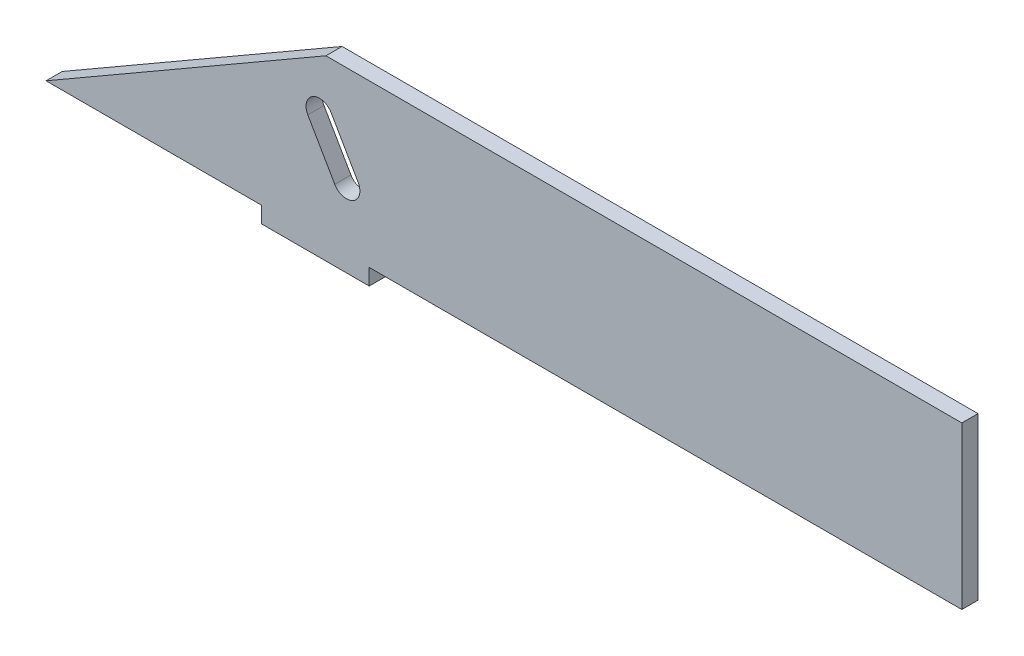
ISO-10303-21;
HEADER;
FILE_DESCRIPTION(('STEP AP214'),'2;1');
FILE_NAME('part.step','',(''),(''),'','','');
FILE_SCHEMA(('AUTOMOTIVE_DESIGN { 1 0 10303 214 1 1 1 1 }'));
ENDSEC;
DATA;
#1=APPLICATION_CONTEXT('core data for automotive mechanical design processes');
#2=APPLICATION_PROTOCOL_DEFINITION('international standard','automotive_design',2000,#1);
#3=PRODUCT_CONTEXT('',#1,'mechanical');
#4=PRODUCT('Part','Part','',(#3));
#5=PRODUCT_RELATED_PRODUCT_CATEGORY('part','',(#4));
#6=PRODUCT_DEFINITION_FORMATION('','',#4);
#7=PRODUCT_DEFINITION_CONTEXT('part definition',#1,'design');
#8=PRODUCT_DEFINITION('design','',#6,#7);
#9=PRODUCT_DEFINITION_SHAPE('','',#8);
#10=(LENGTH_UNIT() NAMED_UNIT(*) SI_UNIT(.MILLI.,.METRE.));
#11=(NAMED_UNIT(*) PLANE_ANGLE_UNIT() SI_UNIT($,.RADIAN.));
#12=(NAMED_UNIT(*) SI_UNIT($,.STERADIAN.) SOLID_ANGLE_UNIT());
#13=UNCERTAINTY_MEASURE_WITH_UNIT(LENGTH_MEASURE(1.E-05),#10,'distance_accuracy_value','');
#14=(GEOMETRIC_REPRESENTATION_CONTEXT(3) GLOBAL_UNCERTAINTY_ASSIGNED_CONTEXT((#13)) GLOBAL_UNIT_ASSIGNED_CONTEXT((#10,
#11,#12)) REPRESENTATION_CONTEXT('',''));
#15=CARTESIAN_POINT('',(0.,0.,0.));
#16=DIRECTION('',(0.,0.,1.));
#17=DIRECTION('',(1.,0.,0.));
#18=AXIS2_PLACEMENT_3D('',#15,#16,#17);
#19=CARTESIAN_POINT('',(50.,15.,3.));
#20=DIRECTION('',(0.,-1.,0.));
#21=DIRECTION('',(1.,0.,0.));
#22=AXIS2_PLACEMENT_3D('',#19,#20,#21);
#23=PLANE('',#22);
#24=DIRECTION('',(0.,0.,-1.));
#25=VECTOR('',#24,1.);
#26=CARTESIAN_POINT('',(1.96152422706574,15.,138.433806901228));
#27=LINE('',#26,#25);
#28=CARTESIAN_POINT('',(1.96152422706574,15.,3.00000000000006));
#29=VERTEX_POINT('',#28);
#30=CARTESIAN_POINT('',(1.9615242270659,15.,0.));
#31=VERTEX_POINT('',#30);
#32=EDGE_CURVE('E195',#29,#31,#27,.T.);
#33=ORIENTED_EDGE('',*,*,#32,.F.);
#34=DIRECTION('',(-1.,0.,0.));
#35=VECTOR('',#34,1.);
#36=CARTESIAN_POINT('',(50.,15.,3.));
#37=LINE('',#36,#35);
#38=CARTESIAN_POINT('',(120.,15.,3.));
#39=VERTEX_POINT('',#38);
#40=EDGE_CURVE('E141',#39,#29,#37,.T.);
#41=ORIENTED_EDGE('',*,*,#40,.F.);
#42=DIRECTION('',(0.,0.,1.));
#43=VECTOR('',#42,1.);
#44=CARTESIAN_POINT('',(120.,15.,3.));
#45=LINE('',#44,#43);
#46=CARTESIAN_POINT('',(120.,15.,0.));
#47=VERTEX_POINT('',#46);
#48=EDGE_CURVE('E157',#47,#39,#45,.T.);
#49=ORIENTED_EDGE('',*,*,#48,.F.);
#50=DIRECTION('',(-1.,0.,0.));
#51=VECTOR('',#50,1.);
#52=CARTESIAN_POINT('',(50.,15.,0.));
#53=LINE('',#52,#51);
#54=EDGE_CURVE('E205',#47,#31,#53,.T.);
#55=ORIENTED_EDGE('',*,*,#54,.T.);
#56=EDGE_LOOP('',(#33,#41,#49,#55));
#57=FACE_BOUND('',#56,.T.);
#58=ADVANCED_FACE('F39',(#57),#23,.F.);
#59=CARTESIAN_POINT('',(-10.,-15.,3.));
#60=DIRECTION('',(0.,1.,0.));
#61=DIRECTION('',(-1.,0.,0.));
#62=AXIS2_PLACEMENT_3D('',#59,#60,#61);
#63=PLANE('',#62);
#64=DIRECTION('',(1.,0.,0.));
#65=VECTOR('',#64,1.);
#66=CARTESIAN_POINT('',(-10.,-15.,0.));
#67=LINE('',#66,#65);
#68=CARTESIAN_POINT('',(-50.,-15.,0.));
#69=VERTEX_POINT('',#68);
#70=CARTESIAN_POINT('',(-10.,-15.,0.));
#71=VERTEX_POINT('',#70);
#72=EDGE_CURVE('E194',#69,#71,#67,.T.);
#73=ORIENTED_EDGE('',*,*,#72,.T.);
#74=DIRECTION('',(0.,0.,-1.));
#75=VECTOR('',#74,1.);
#76=CARTESIAN_POINT('',(-10.,-15.,3.));
#77=LINE('',#76,#75);
#78=CARTESIAN_POINT('',(-10.,-15.,3.));
#79=VERTEX_POINT('',#78);
#80=EDGE_CURVE('E242',#79,#71,#77,.T.);
#81=ORIENTED_EDGE('',*,*,#80,.F.);
#82=DIRECTION('',(1.,0.,0.));
#83=VECTOR('',#82,1.);
#84=CARTESIAN_POINT('',(-10.,-15.,3.));
#85=LINE('',#84,#83);
#86=CARTESIAN_POINT('',(-50.,-15.,3.));
#87=VERTEX_POINT('',#86);
#88=EDGE_CURVE('E201',#87,#79,#85,.T.);
#89=ORIENTED_EDGE('',*,*,#88,.F.);
#90=DIRECTION('',(0.,0.,-1.));
#91=VECTOR('',#90,1.);
#92=CARTESIAN_POINT('',(-50.,-15.,3.));
#93=LINE('',#92,#91);
#94=EDGE_CURVE('E246',#87,#69,#93,.T.);
#95=ORIENTED_EDGE('',*,*,#94,.T.);
#96=EDGE_LOOP('',(#73,#81,#89,#95));
#97=FACE_BOUND('',#96,.T.);
#98=ADVANCED_FACE('F41',(#97),#63,.F.);
#99=CARTESIAN_POINT('',(-10.,-15.,3.));
#100=DIRECTION('',(1.,0.,0.));
#101=DIRECTION('',(0.,0.,-1.));
#102=AXIS2_PLACEMENT_3D('',#99,#100,#101);
#103=PLANE('',#102);
#104=DIRECTION('',(0.,-1.,0.));
#105=VECTOR('',#104,1.);
#106=CARTESIAN_POINT('',(-10.,-15.,0.));
#107=LINE('',#106,#105);
#108=CARTESIAN_POINT('',(-10.,-18.,0.));
#109=VERTEX_POINT('',#108);
#110=EDGE_CURVE('E218',#71,#109,#107,.T.);
#111=ORIENTED_EDGE('',*,*,#110,.T.);
#112=DIRECTION('',(0.,0.,-1.));
#113=VECTOR('',#112,1.);
#114=CARTESIAN_POINT('',(-10.,-18.,3.));
#115=LINE('',#114,#113);
#116=CARTESIAN_POINT('',(-10.,-18.,3.));
#117=VERTEX_POINT('',#116);
#118=EDGE_CURVE('E238',#117,#109,#115,.T.);
#119=ORIENTED_EDGE('',*,*,#118,.F.);
#120=DIRECTION('',(0.,-1.,0.));
#121=VECTOR('',#120,1.);
#122=CARTESIAN_POINT('',(-10.,-15.,3.));
#123=LINE('',#122,#121);
#124=EDGE_CURVE('E204',#79,#117,#123,.T.);
#125=ORIENTED_EDGE('',*,*,#124,.F.);
#126=ORIENTED_EDGE('',*,*,#80,.T.);
#127=EDGE_LOOP('',(#111,#119,#125,#126));
#128=FACE_BOUND('',#127,.T.);
#129=ADVANCED_FACE('F291',(#128),#103,.F.);
#130=CARTESIAN_POINT('',(-10.,-18.,3.));
#131=DIRECTION('',(0.,1.,0.));
#132=DIRECTION('',(0.,0.,1.));
#133=AXIS2_PLACEMENT_3D('',#130,#131,#132);
#134=PLANE('',#133);
#135=DIRECTION('',(1.,0.,0.));
#136=VECTOR('',#135,1.);
#137=CARTESIAN_POINT('',(-10.,-18.,0.));
#138=LINE('',#137,#136);
#139=CARTESIAN_POINT('',(10.,-18.,0.));
#140=VERTEX_POINT('',#139);
#141=EDGE_CURVE('E221',#109,#140,#138,.T.);
#142=ORIENTED_EDGE('',*,*,#141,.T.);
#143=DIRECTION('',(0.,0.,-1.));
#144=VECTOR('',#143,1.);
#145=CARTESIAN_POINT('',(10.,-18.,3.));
#146=LINE('',#145,#144);
#147=CARTESIAN_POINT('',(10.,-18.,3.));
#148=VERTEX_POINT('',#147);
#149=EDGE_CURVE('E234',#148,#140,#146,.T.);
#150=ORIENTED_EDGE('',*,*,#149,.F.);
#151=DIRECTION('',(1.,0.,0.));
#152=VECTOR('',#151,1.);
#153=CARTESIAN_POINT('',(-10.,-18.,3.));
#154=LINE('',#153,#152);
#155=EDGE_CURVE('E208',#117,#148,#154,.T.);
#156=ORIENTED_EDGE('',*,*,#155,.F.);
#157=ORIENTED_EDGE('',*,*,#118,.T.);
#158=EDGE_LOOP('',(#142,#150,#156,#157));
#159=FACE_BOUND('',#158,.T.);
#160=ADVANCED_FACE('F302',(#159),#134,.F.);
#161=CARTESIAN_POINT('',(10.,-18.,3.));
#162=DIRECTION('',(-1.,0.,0.));
#163=DIRECTION('',(0.,-1.,0.));
#164=AXIS2_PLACEMENT_3D('',#161,#162,#163);
#165=PLANE('',#164);
#166=DIRECTION('',(0.,1.,0.));
#167=VECTOR('',#166,1.);
#168=CARTESIAN_POINT('',(10.,-18.,0.));
#169=LINE('',#168,#167);
#170=CARTESIAN_POINT('',(10.,-15.,0.));
#171=VERTEX_POINT('',#170);
#172=EDGE_CURVE('E224',#140,#171,#169,.T.);
#173=ORIENTED_EDGE('',*,*,#172,.T.);
#174=DIRECTION('',(0.,0.,-1.));
#175=VECTOR('',#174,1.);
#176=CARTESIAN_POINT('',(10.,-15.,3.));
#177=LINE('',#176,#175);
#178=CARTESIAN_POINT('',(10.,-15.,3.));
#179=VERTEX_POINT('',#178);
#180=EDGE_CURVE('E215',#179,#171,#177,.T.);
#181=ORIENTED_EDGE('',*,*,#180,.F.);
#182=DIRECTION('',(0.,1.,0.));
#183=VECTOR('',#182,1.);
#184=CARTESIAN_POINT('',(10.,-18.,3.));
#185=LINE('',#184,#183);
#186=EDGE_CURVE('E136',#148,#179,#185,.T.);
#187=ORIENTED_EDGE('',*,*,#186,.F.);
#188=ORIENTED_EDGE('',*,*,#149,.T.);
#189=EDGE_LOOP('',(#173,#181,#187,#188));
#190=FACE_BOUND('',#189,.T.);
#191=ADVANCED_FACE('F299',(#190),#165,.F.);
#192=CARTESIAN_POINT('',(50.,-15.,3.));
#193=DIRECTION('',(0.,1.,0.));
#194=DIRECTION('',(-1.,0.,0.));
#195=AXIS2_PLACEMENT_3D('',#192,#193,#194);
#196=PLANE('',#195);
#197=DIRECTION('',(1.,0.,0.));
#198=VECTOR('',#197,1.);
#199=CARTESIAN_POINT('',(50.,-15.,0.));
#200=LINE('',#199,#198);
#201=CARTESIAN_POINT('',(120.,-15.,0.));
#202=VERTEX_POINT('',#201);
#203=EDGE_CURVE('E147',#171,#202,#200,.T.);
#204=ORIENTED_EDGE('',*,*,#203,.T.);
#205=DIRECTION('',(0.,0.,-1.));
#206=VECTOR('',#205,1.);
#207=CARTESIAN_POINT('',(120.,-15.,3.));
#208=LINE('',#207,#206);
#209=CARTESIAN_POINT('',(120.,-15.,3.));
#210=VERTEX_POINT('',#209);
#211=EDGE_CURVE('E144',#210,#202,#208,.T.);
#212=ORIENTED_EDGE('',*,*,#211,.F.);
#213=DIRECTION('',(1.,0.,0.));
#214=VECTOR('',#213,1.);
#215=CARTESIAN_POINT('',(50.,-15.,3.));
#216=LINE('',#215,#214);
#217=EDGE_CURVE('E130',#179,#210,#216,.T.);
#218=ORIENTED_EDGE('',*,*,#217,.F.);
#219=ORIENTED_EDGE('',*,*,#180,.T.);
#220=EDGE_LOOP('',(#204,#212,#218,#219));
#221=FACE_BOUND('',#220,.T.);
#222=ADVANCED_FACE('F145',(#221),#196,.F.);
#223=CARTESIAN_POINT('',(0.,0.,3.));
#224=DIRECTION('',(0.,0.,1.));
#225=DIRECTION('',(1.,0.,0.));
#226=AXIS2_PLACEMENT_3D('',#223,#224,#225);
#227=PLANE('',#226);
#228=CARTESIAN_POINT('',(5.76537180435926,-3.58845726812014,3.));
#229=DIRECTION('',(0.,0.,1.));
#230=DIRECTION('',(1.,0.,0.));
#231=AXIS2_PLACEMENT_3D('',#228,#229,#230);
#232=CIRCLE('',#231,2.5);
#233=CARTESIAN_POINT('',(3.60030829489816,-4.83845726812014,3.));
#234=VERTEX_POINT('',#233);
#235=CARTESIAN_POINT('',(7.93043531382035,-2.33845726812014,3.));
#236=VERTEX_POINT('',#235);
#237=EDGE_CURVE('E55',#234,#236,#232,.T.);
#238=ORIENTED_EDGE('',*,*,#237,.F.);
#239=DIRECTION('',(0.5,-0.866025403784439,0.));
#240=VECTOR('',#239,1.);
#241=CARTESIAN_POINT('',(3.60030829489816,-4.83845726812014,3.));
#242=LINE('',#241,#240);
#243=CARTESIAN_POINT('',(-1.39969170510184,3.82179676972425,3.));
#244=VERTEX_POINT('',#243);
#245=EDGE_CURVE('E174',#244,#234,#242,.T.);
#246=ORIENTED_EDGE('',*,*,#245,.F.);
#247=CARTESIAN_POINT('',(0.765371804359261,5.07179676972425,3.));
#248=DIRECTION('',(0.,0.,1.));
#249=DIRECTION('',(1.,0.,0.));
#250=AXIS2_PLACEMENT_3D('',#247,#248,#249);
#251=CIRCLE('',#250,2.5);
#252=CARTESIAN_POINT('',(2.93043531382036,6.32179676972425,3.));
#253=VERTEX_POINT('',#252);
#254=EDGE_CURVE('E170',#253,#244,#251,.T.);
#255=ORIENTED_EDGE('',*,*,#254,.F.);
#256=DIRECTION('',(-0.5,0.866025403784439,0.));
#257=VECTOR('',#256,1.);
#258=CARTESIAN_POINT('',(7.93043531382035,-2.33845726812014,3.));
#259=LINE('',#258,#257);
#260=EDGE_CURVE('E167',#236,#253,#259,.T.);
#261=ORIENTED_EDGE('',*,*,#260,.F.);
#262=EDGE_LOOP('',(#238,#246,#255,#261));
#263=FACE_BOUND('',#262,.T.);
#264=DIRECTION('',(0.866025403784436,0.500000000000004,0.));
#265=VECTOR('',#264,1.);
#266=CARTESIAN_POINT('',(-50.,-15.,3.));
#267=LINE('',#266,#265);
#268=EDGE_CURVE('E190',#87,#29,#267,.T.);
#269=ORIENTED_EDGE('',*,*,#268,.F.);
#270=ORIENTED_EDGE('',*,*,#88,.T.);
#271=ORIENTED_EDGE('',*,*,#124,.T.);
#272=ORIENTED_EDGE('',*,*,#155,.T.);
#273=ORIENTED_EDGE('',*,*,#186,.T.);
#274=ORIENTED_EDGE('',*,*,#217,.T.);
#275=DIRECTION('',(0.,-1.,0.));
#276=VECTOR('',#275,1.);
#277=CARTESIAN_POINT('',(120.,-15.,3.));
#278=LINE('',#277,#276);
#279=EDGE_CURVE('E134',#39,#210,#278,.T.);
#280=ORIENTED_EDGE('',*,*,#279,.F.);
#281=ORIENTED_EDGE('',*,*,#40,.T.);
#282=EDGE_LOOP('',(#269,#270,#271,#272,#273,#274,#280,#281));
#283=FACE_BOUND('',#282,.T.);
#284=ADVANCED_FACE('F132',(#263,#283),#227,.T.);
#285=CARTESIAN_POINT('',(0.,0.,0.));
#286=DIRECTION('',(0.,0.,1.));
#287=DIRECTION('',(1.,0.,0.));
#288=AXIS2_PLACEMENT_3D('',#285,#286,#287);
#289=PLANE('',#288);
#290=DIRECTION('',(0.5,-0.866025403784439,0.));
#291=VECTOR('',#290,1.);
#292=CARTESIAN_POINT('',(0.605117766514875,0.349364905388788,0.));
#293=LINE('',#292,#291);
#294=CARTESIAN_POINT('',(-1.39969170510184,3.82179676972425,0.));
#295=VERTEX_POINT('',#294);
#296=CARTESIAN_POINT('',(3.60030829489816,-4.83845726812014,0.));
#297=VERTEX_POINT('',#296);
#298=EDGE_CURVE('E48',#295,#297,#293,.T.);
#299=ORIENTED_EDGE('',*,*,#298,.T.);
#300=CARTESIAN_POINT('',(5.76537180435926,-3.58845726812014,0.));
#301=DIRECTION('',(0.,0.,1.));
#302=DIRECTION('',(1.,0.,0.));
#303=AXIS2_PLACEMENT_3D('',#300,#301,#302);
#304=CIRCLE('',#303,2.5);
#305=CARTESIAN_POINT('',(7.93043531382035,-2.33845726812014,0.));
#306=VERTEX_POINT('',#305);
#307=EDGE_CURVE('E11',#297,#306,#304,.T.);
#308=ORIENTED_EDGE('',*,*,#307,.T.);
#309=DIRECTION('',(-0.5,0.866025403784439,0.));
#310=VECTOR('',#309,1.);
#311=CARTESIAN_POINT('',(4.93524478543707,2.84936490538879,0.));
#312=LINE('',#311,#310);
#313=CARTESIAN_POINT('',(2.93043531382036,6.32179676972425,0.));
#314=VERTEX_POINT('',#313);
#315=EDGE_CURVE('E250',#306,#314,#312,.T.);
#316=ORIENTED_EDGE('',*,*,#315,.T.);
#317=CARTESIAN_POINT('',(0.765371804359261,5.07179676972425,0.));
#318=DIRECTION('',(0.,0.,1.));
#319=DIRECTION('',(1.,0.,0.));
#320=AXIS2_PLACEMENT_3D('',#317,#318,#319);
#321=CIRCLE('',#320,2.5);
#322=EDGE_CURVE('E254',#314,#295,#321,.T.);
#323=ORIENTED_EDGE('',*,*,#322,.T.);
#324=EDGE_LOOP('',(#299,#308,#316,#323));
#325=FACE_BOUND('',#324,.T.);
#326=ORIENTED_EDGE('',*,*,#72,.F.);
#327=DIRECTION('',(0.866025403784436,0.500000000000004,0.));
#328=VECTOR('',#327,1.);
#329=CARTESIAN_POINT('',(-50.,-15.,0.));
#330=LINE('',#329,#328);
#331=EDGE_CURVE('E182',#69,#31,#330,.T.);
#332=ORIENTED_EDGE('',*,*,#331,.T.);
#333=ORIENTED_EDGE('',*,*,#54,.F.);
#334=DIRECTION('',(0.,1.,0.));
#335=VECTOR('',#334,1.);
#336=CARTESIAN_POINT('',(120.,-15.,0.));
#337=LINE('',#336,#335);
#338=EDGE_CURVE('E152',#202,#47,#337,.T.);
#339=ORIENTED_EDGE('',*,*,#338,.F.);
#340=ORIENTED_EDGE('',*,*,#203,.F.);
#341=ORIENTED_EDGE('',*,*,#172,.F.);
#342=ORIENTED_EDGE('',*,*,#141,.F.);
#343=ORIENTED_EDGE('',*,*,#110,.F.);
#344=EDGE_LOOP('',(#326,#332,#333,#339,#340,#341,#342,#343));
#345=FACE_BOUND('',#344,.T.);
#346=ADVANCED_FACE('F260',(#325,#345),#289,.F.);
#347=CARTESIAN_POINT('',(-50.,-15.,138.433806901228));
#348=DIRECTION('',(-0.500000000000004,0.866025403784436,0.));
#349=DIRECTION('',(-0.866025403784436,-0.500000000000004,0.));
#350=AXIS2_PLACEMENT_3D('',#347,#348,#349);
#351=PLANE('',#350);
#352=ORIENTED_EDGE('',*,*,#94,.F.);
#353=ORIENTED_EDGE('',*,*,#268,.T.);
#354=ORIENTED_EDGE('',*,*,#32,.T.);
#355=ORIENTED_EDGE('',*,*,#331,.F.);
#356=EDGE_LOOP('',(#352,#353,#354,#355));
#357=FACE_BOUND('',#356,.T.);
#358=ADVANCED_FACE('F275',(#357),#351,.T.);
#359=CARTESIAN_POINT('',(5.76537180435926,-3.58845726812014,-1.));
#360=DIRECTION('',(0.,0.,1.));
#361=DIRECTION('',(1.,0.,0.));
#362=AXIS2_PLACEMENT_3D('',#359,#360,#361);
#363=CYLINDRICAL_SURFACE('',#362,2.5);
#364=DIRECTION('',(0.,0.,1.));
#365=VECTOR('',#364,1.);
#366=CARTESIAN_POINT('',(3.60030829489816,-4.83845726812014,-1.));
#367=LINE('',#366,#365);
#368=EDGE_CURVE('E179',#297,#234,#367,.T.);
#369=ORIENTED_EDGE('',*,*,#368,.T.);
#370=ORIENTED_EDGE('',*,*,#237,.T.);
#371=DIRECTION('',(0.,0.,1.));
#372=VECTOR('',#371,1.);
#373=CARTESIAN_POINT('',(7.93043531382035,-2.33845726812014,-1.));
#374=LINE('',#373,#372);
#375=EDGE_CURVE('E178',#306,#236,#374,.T.);
#376=ORIENTED_EDGE('',*,*,#375,.F.);
#377=ORIENTED_EDGE('',*,*,#307,.F.);
#378=EDGE_LOOP('',(#369,#370,#376,#377));
#379=FACE_BOUND('',#378,.T.);
#380=ADVANCED_FACE('F273',(#379),#363,.F.);
#381=CARTESIAN_POINT('',(3.60030829489816,-4.83845726812014,-1.));
#382=DIRECTION('',(-0.866025403784439,-0.5,0.));
#383=DIRECTION('',(0.5,-0.866025403784439,0.));
#384=AXIS2_PLACEMENT_3D('',#381,#382,#383);
#385=PLANE('',#384);
#386=DIRECTION('',(0.,0.,1.));
#387=VECTOR('',#386,1.);
#388=CARTESIAN_POINT('',(-1.39969170510184,3.82179676972425,-1.));
#389=LINE('',#388,#387);
#390=EDGE_CURVE('E183',#295,#244,#389,.T.);
#391=ORIENTED_EDGE('',*,*,#390,.T.);
#392=ORIENTED_EDGE('',*,*,#245,.T.);
#393=ORIENTED_EDGE('',*,*,#368,.F.);
#394=ORIENTED_EDGE('',*,*,#298,.F.);
#395=EDGE_LOOP('',(#391,#392,#393,#394));
#396=FACE_BOUND('',#395,.T.);
#397=ADVANCED_FACE('F265',(#396),#385,.F.);
#398=CARTESIAN_POINT('',(0.765371804359261,5.07179676972425,-1.));
#399=DIRECTION('',(0.,0.,1.));
#400=DIRECTION('',(1.,0.,0.));
#401=AXIS2_PLACEMENT_3D('',#398,#399,#400);
#402=CYLINDRICAL_SURFACE('',#401,2.5);
#403=DIRECTION('',(0.,0.,1.));
#404=VECTOR('',#403,1.);
#405=CARTESIAN_POINT('',(2.93043531382036,6.32179676972425,-1.));
#406=LINE('',#405,#404);
#407=EDGE_CURVE('E63',#314,#253,#406,.T.);
#408=ORIENTED_EDGE('',*,*,#407,.T.);
#409=ORIENTED_EDGE('',*,*,#254,.T.);
#410=ORIENTED_EDGE('',*,*,#390,.F.);
#411=ORIENTED_EDGE('',*,*,#322,.F.);
#412=EDGE_LOOP('',(#408,#409,#410,#411));
#413=FACE_BOUND('',#412,.T.);
#414=ADVANCED_FACE('F267',(#413),#402,.F.);
#415=CARTESIAN_POINT('',(7.93043531382035,-2.33845726812014,-1.));
#416=DIRECTION('',(0.866025403784439,0.5,0.));
#417=DIRECTION('',(-0.5,0.866025403784439,0.));
#418=AXIS2_PLACEMENT_3D('',#415,#416,#417);
#419=PLANE('',#418);
#420=ORIENTED_EDGE('',*,*,#375,.T.);
#421=ORIENTED_EDGE('',*,*,#260,.T.);
#422=ORIENTED_EDGE('',*,*,#407,.F.);
#423=ORIENTED_EDGE('',*,*,#315,.F.);
#424=EDGE_LOOP('',(#420,#421,#422,#423));
#425=FACE_BOUND('',#424,.T.);
#426=ADVANCED_FACE('F272',(#425),#419,.F.);
#427=CARTESIAN_POINT('',(120.,0.,0.));
#428=DIRECTION('',(-1.,0.,0.));
#429=DIRECTION('',(0.,0.,1.));
#430=AXIS2_PLACEMENT_3D('',#427,#428,#429);
#431=PLANE('',#430);
#432=ORIENTED_EDGE('',*,*,#279,.T.);
#433=ORIENTED_EDGE('',*,*,#211,.T.);
#434=ORIENTED_EDGE('',*,*,#338,.T.);
#435=ORIENTED_EDGE('',*,*,#48,.T.);
#436=EDGE_LOOP('',(#432,#433,#434,#435));
#437=FACE_BOUND('',#436,.T.);
#438=ADVANCED_FACE('F155',(#437),#431,.F.);
#439=CLOSED_SHELL('',(#58,#98,#129,#160,#191,#222,#284,#346,#358,#380,#397,#414,#426,#438));
#440=MANIFOLD_SOLID_BREP('B2',#439);
#441=ADVANCED_BREP_SHAPE_REPRESENTATION('',(#18,#440),#14);
#442=SHAPE_DEFINITION_REPRESENTATION(#9,#441);
ENDSEC;
END-ISO-10303-21;
